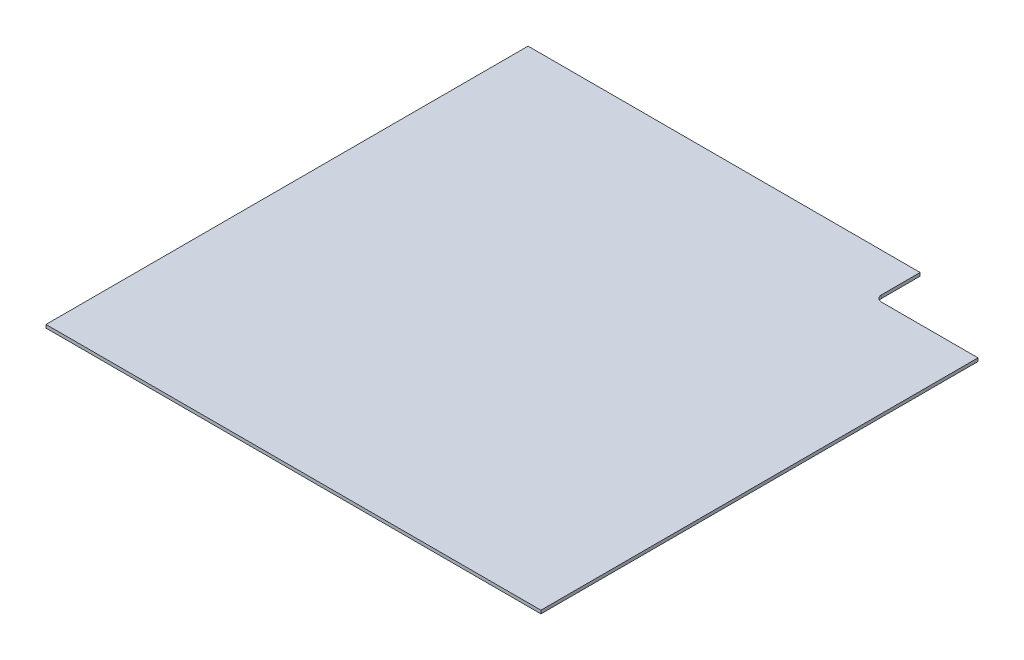
ISO-10303-21;
HEADER;
FILE_DESCRIPTION(('STEP AP214'),'2;1');
FILE_NAME('part.step','',(''),(''),'','','');
FILE_SCHEMA(('AUTOMOTIVE_DESIGN { 1 0 10303 214 1 1 1 1 }'));
ENDSEC;
DATA;
#1=APPLICATION_CONTEXT('core data for automotive mechanical design processes');
#2=APPLICATION_PROTOCOL_DEFINITION('international standard','automotive_design',2000,#1);
#3=PRODUCT_CONTEXT('',#1,'mechanical');
#4=PRODUCT('Part','Part','',(#3));
#5=PRODUCT_RELATED_PRODUCT_CATEGORY('part','',(#4));
#6=PRODUCT_DEFINITION_FORMATION('','',#4);
#7=PRODUCT_DEFINITION_CONTEXT('part definition',#1,'design');
#8=PRODUCT_DEFINITION('design','',#6,#7);
#9=PRODUCT_DEFINITION_SHAPE('','',#8);
#10=(LENGTH_UNIT() NAMED_UNIT(*) SI_UNIT(.MILLI.,.METRE.));
#11=(NAMED_UNIT(*) PLANE_ANGLE_UNIT() SI_UNIT($,.RADIAN.));
#12=(NAMED_UNIT(*) SI_UNIT($,.STERADIAN.) SOLID_ANGLE_UNIT());
#13=UNCERTAINTY_MEASURE_WITH_UNIT(LENGTH_MEASURE(1.E-05),#10,'distance_accuracy_value','');
#14=(GEOMETRIC_REPRESENTATION_CONTEXT(3) GLOBAL_UNCERTAINTY_ASSIGNED_CONTEXT((#13)) GLOBAL_UNIT_ASSIGNED_CONTEXT((#10,
#11,#12)) REPRESENTATION_CONTEXT('',''));
#15=CARTESIAN_POINT('',(0.,0.,0.));
#16=DIRECTION('',(0.,0.,1.));
#17=DIRECTION('',(1.,0.,0.));
#18=AXIS2_PLACEMENT_3D('',#15,#16,#17);
#19=CARTESIAN_POINT('',(5845.175,-3.175,238.125));
#20=DIRECTION('',(0.,-1.,0.));
#21=DIRECTION('',(0.,0.,-1.));
#22=AXIS2_PLACEMENT_3D('',#19,#20,#21);
#23=PLANE('',#22);
#24=DIRECTION('',(1.,0.,0.));
#25=VECTOR('',#24,1.);
#26=CARTESIAN_POINT('',(5845.175,-3.175,476.25));
#27=LINE('',#26,#25);
#28=CARTESIAN_POINT('',(5600.7,-3.175,476.25));
#29=VERTEX_POINT('',#28);
#30=CARTESIAN_POINT('',(6089.65,-3.175,476.25));
#31=VERTEX_POINT('',#30);
#32=EDGE_CURVE('E76',#29,#31,#27,.T.);
#33=ORIENTED_EDGE('',*,*,#32,.F.);
#34=DIRECTION('',(0.,0.,1.));
#35=VECTOR('',#34,1.);
#36=CARTESIAN_POINT('',(5600.7,-3.175,238.125));
#37=LINE('',#36,#35);
#38=CARTESIAN_POINT('',(5600.7,-3.175,0.));
#39=VERTEX_POINT('',#38);
#40=EDGE_CURVE('E96',#39,#29,#37,.T.);
#41=ORIENTED_EDGE('',*,*,#40,.F.);
#42=DIRECTION('',(1.,0.,0.));
#43=VECTOR('',#42,1.);
#44=CARTESIAN_POINT('',(5845.175,-3.175,0.));
#45=LINE('',#44,#43);
#46=CARTESIAN_POINT('',(5988.05,-3.175,0.));
#47=VERTEX_POINT('',#46);
#48=EDGE_CURVE('E112',#39,#47,#45,.T.);
#49=ORIENTED_EDGE('',*,*,#48,.T.);
#50=DIRECTION('',(0.,0.,-1.));
#51=VECTOR('',#50,1.);
#52=CARTESIAN_POINT('',(5988.05,-3.175,22.225));
#53=LINE('',#52,#51);
#54=CARTESIAN_POINT('',(5988.05,-3.175,38.1));
#55=VERTEX_POINT('',#54);
#56=EDGE_CURVE('E45',#55,#47,#53,.T.);
#57=ORIENTED_EDGE('',*,*,#56,.F.);
#58=CARTESIAN_POINT('',(5994.4,-3.175,38.1));
#59=DIRECTION('',(0.,1.,0.));
#60=DIRECTION('',(0.,0.,1.));
#61=AXIS2_PLACEMENT_3D('',#58,#59,#60);
#62=CIRCLE('',#61,6.35);
#63=CARTESIAN_POINT('',(5994.4,-3.175,44.45));
#64=VERTEX_POINT('',#63);
#65=EDGE_CURVE('E17',#55,#64,#62,.T.);
#66=ORIENTED_EDGE('',*,*,#65,.T.);
#67=DIRECTION('',(1.,0.,0.));
#68=VECTOR('',#67,1.);
#69=CARTESIAN_POINT('',(6044.96930074391,-3.175,44.45));
#70=LINE('',#69,#68);
#71=CARTESIAN_POINT('',(6089.65,-3.175,44.45));
#72=VERTEX_POINT('',#71);
#73=EDGE_CURVE('E87',#64,#72,#70,.T.);
#74=ORIENTED_EDGE('',*,*,#73,.T.);
#75=DIRECTION('',(0.,0.,1.));
#76=VECTOR('',#75,1.);
#77=CARTESIAN_POINT('',(6089.65,-3.175,238.125));
#78=LINE('',#77,#76);
#79=EDGE_CURVE('E84',#72,#31,#78,.T.);
#80=ORIENTED_EDGE('',*,*,#79,.T.);
#81=EDGE_LOOP('',(#33,#41,#49,#57,#66,#74,#80));
#82=FACE_BOUND('',#81,.T.);
#83=ADVANCED_FACE('F14',(#82),#23,.T.);
#84=CARTESIAN_POINT('',(6089.65,-3.175,238.125));
#85=DIRECTION('',(-1.,0.,0.));
#86=DIRECTION('',(0.,0.,1.));
#87=AXIS2_PLACEMENT_3D('',#84,#85,#86);
#88=PLANE('',#87);
#89=DIRECTION('',(0.,0.,-1.));
#90=VECTOR('',#89,1.);
#91=CARTESIAN_POINT('',(6089.65,0.,238.125));
#92=LINE('',#91,#90);
#93=CARTESIAN_POINT('',(6089.65,0.,44.45));
#94=VERTEX_POINT('',#93);
#95=CARTESIAN_POINT('',(6089.65,0.,476.25));
#96=VERTEX_POINT('',#95);
#97=EDGE_CURVE('E95',#94,#96,#92,.F.);
#98=ORIENTED_EDGE('',*,*,#97,.T.);
#99=DIRECTION('',(0.,1.,0.));
#100=VECTOR('',#99,1.);
#101=CARTESIAN_POINT('',(6089.65,-3.175,476.25));
#102=LINE('',#101,#100);
#103=EDGE_CURVE('E81',#31,#96,#102,.T.);
#104=ORIENTED_EDGE('',*,*,#103,.F.);
#105=ORIENTED_EDGE('',*,*,#79,.F.);
#106=DIRECTION('',(0.,1.,0.));
#107=VECTOR('',#106,1.);
#108=CARTESIAN_POINT('',(6089.65,0.00199999999999983,44.45));
#109=LINE('',#108,#107);
#110=EDGE_CURVE('E139',#72,#94,#109,.T.);
#111=ORIENTED_EDGE('',*,*,#110,.T.);
#112=EDGE_LOOP('',(#98,#104,#105,#111));
#113=FACE_BOUND('',#112,.T.);
#114=ADVANCED_FACE('F93',(#113),#88,.F.);
#115=CARTESIAN_POINT('',(5845.175,-3.175,476.25));
#116=DIRECTION('',(0.,0.,1.));
#117=DIRECTION('',(1.,0.,0.));
#118=AXIS2_PLACEMENT_3D('',#115,#116,#117);
#119=PLANE('',#118);
#120=ORIENTED_EDGE('',*,*,#32,.T.);
#121=ORIENTED_EDGE('',*,*,#103,.T.);
#122=DIRECTION('',(1.,0.,0.));
#123=VECTOR('',#122,1.);
#124=CARTESIAN_POINT('',(5845.175,0.,476.25));
#125=LINE('',#124,#123);
#126=CARTESIAN_POINT('',(5600.7,0.,476.25));
#127=VERTEX_POINT('',#126);
#128=EDGE_CURVE('E144',#96,#127,#125,.F.);
#129=ORIENTED_EDGE('',*,*,#128,.T.);
#130=DIRECTION('',(0.,1.,0.));
#131=VECTOR('',#130,1.);
#132=CARTESIAN_POINT('',(5600.7,-3.175,476.25));
#133=LINE('',#132,#131);
#134=EDGE_CURVE('E83',#29,#127,#133,.T.);
#135=ORIENTED_EDGE('',*,*,#134,.F.);
#136=EDGE_LOOP('',(#120,#121,#129,#135));
#137=FACE_BOUND('',#136,.T.);
#138=ADVANCED_FACE('F78',(#137),#119,.T.);
#139=CARTESIAN_POINT('',(5600.7,-3.175,238.125));
#140=DIRECTION('',(-1.,0.,0.));
#141=DIRECTION('',(0.,0.,1.));
#142=AXIS2_PLACEMENT_3D('',#139,#140,#141);
#143=PLANE('',#142);
#144=ORIENTED_EDGE('',*,*,#40,.T.);
#145=ORIENTED_EDGE('',*,*,#134,.T.);
#146=DIRECTION('',(0.,0.,-1.));
#147=VECTOR('',#146,1.);
#148=CARTESIAN_POINT('',(5600.7,0.,238.125));
#149=LINE('',#148,#147);
#150=CARTESIAN_POINT('',(5600.7,0.,0.));
#151=VERTEX_POINT('',#150);
#152=EDGE_CURVE('E131',#127,#151,#149,.T.);
#153=ORIENTED_EDGE('',*,*,#152,.T.);
#154=DIRECTION('',(0.,1.,0.));
#155=VECTOR('',#154,1.);
#156=CARTESIAN_POINT('',(5600.7,-3.175,0.));
#157=LINE('',#156,#155);
#158=EDGE_CURVE('E116',#151,#39,#157,.F.);
#159=ORIENTED_EDGE('',*,*,#158,.T.);
#160=EDGE_LOOP('',(#144,#145,#153,#159));
#161=FACE_BOUND('',#160,.T.);
#162=ADVANCED_FACE('F169',(#161),#143,.T.);
#163=CARTESIAN_POINT('',(5845.175,-3.175,0.));
#164=DIRECTION('',(0.,0.,1.));
#165=DIRECTION('',(1.,0.,0.));
#166=AXIS2_PLACEMENT_3D('',#163,#164,#165);
#167=PLANE('',#166);
#168=DIRECTION('',(0.,1.,0.));
#169=VECTOR('',#168,1.);
#170=CARTESIAN_POINT('',(5988.05,0.00199999999999983,0.));
#171=LINE('',#170,#169);
#172=CARTESIAN_POINT('',(5988.05,0.,0.));
#173=VERTEX_POINT('',#172);
#174=EDGE_CURVE('E111',#47,#173,#171,.T.);
#175=ORIENTED_EDGE('',*,*,#174,.F.);
#176=ORIENTED_EDGE('',*,*,#48,.F.);
#177=ORIENTED_EDGE('',*,*,#158,.F.);
#178=DIRECTION('',(1.,0.,0.));
#179=VECTOR('',#178,1.);
#180=CARTESIAN_POINT('',(5845.175,0.,0.));
#181=LINE('',#180,#179);
#182=EDGE_CURVE('E127',#151,#173,#181,.T.);
#183=ORIENTED_EDGE('',*,*,#182,.T.);
#184=EDGE_LOOP('',(#175,#176,#177,#183));
#185=FACE_BOUND('',#184,.T.);
#186=ADVANCED_FACE('F173',(#185),#167,.F.);
#187=CARTESIAN_POINT('',(5988.05,0.00199999999999983,22.225));
#188=DIRECTION('',(1.,0.,0.));
#189=DIRECTION('',(0.,0.,-1.));
#190=AXIS2_PLACEMENT_3D('',#187,#188,#189);
#191=PLANE('',#190);
#192=ORIENTED_EDGE('',*,*,#56,.T.);
#193=ORIENTED_EDGE('',*,*,#174,.T.);
#194=DIRECTION('',(0.,0.,-1.));
#195=VECTOR('',#194,1.);
#196=CARTESIAN_POINT('',(5988.05,0.,238.125));
#197=LINE('',#196,#195);
#198=CARTESIAN_POINT('',(5988.05,0.,38.1));
#199=VERTEX_POINT('',#198);
#200=EDGE_CURVE('E123',#173,#199,#197,.F.);
#201=ORIENTED_EDGE('',*,*,#200,.T.);
#202=DIRECTION('',(0.,1.,0.));
#203=VECTOR('',#202,1.);
#204=CARTESIAN_POINT('',(5988.05,0.00199999999999983,38.1));
#205=LINE('',#204,#203);
#206=EDGE_CURVE('E147',#199,#55,#205,.F.);
#207=ORIENTED_EDGE('',*,*,#206,.T.);
#208=EDGE_LOOP('',(#192,#193,#201,#207));
#209=FACE_BOUND('',#208,.T.);
#210=ADVANCED_FACE('F174',(#209),#191,.T.);
#211=CARTESIAN_POINT('',(5994.4,0.00199999999999983,38.1));
#212=DIRECTION('',(0.,1.,0.));
#213=DIRECTION('',(0.,0.,1.));
#214=AXIS2_PLACEMENT_3D('',#211,#212,#213);
#215=CYLINDRICAL_SURFACE('',#214,6.35);
#216=DIRECTION('',(0.,1.,0.));
#217=VECTOR('',#216,1.);
#218=CARTESIAN_POINT('',(5994.4,0.00199999999999983,44.45));
#219=LINE('',#218,#217);
#220=CARTESIAN_POINT('',(5994.4,0.,44.45));
#221=VERTEX_POINT('',#220);
#222=EDGE_CURVE('E31',#221,#64,#219,.F.);
#223=ORIENTED_EDGE('',*,*,#222,.T.);
#224=ORIENTED_EDGE('',*,*,#65,.F.);
#225=ORIENTED_EDGE('',*,*,#206,.F.);
#226=CARTESIAN_POINT('',(5994.4,0.,38.1));
#227=DIRECTION('',(0.,1.,0.));
#228=DIRECTION('',(0.,0.,1.));
#229=AXIS2_PLACEMENT_3D('',#226,#227,#228);
#230=CIRCLE('',#229,6.35);
#231=EDGE_CURVE('E23',#199,#221,#230,.T.);
#232=ORIENTED_EDGE('',*,*,#231,.T.);
#233=EDGE_LOOP('',(#223,#224,#225,#232));
#234=FACE_BOUND('',#233,.T.);
#235=ADVANCED_FACE('F176',(#234),#215,.F.);
#236=CARTESIAN_POINT('',(6044.96930074391,0.00199999999999983,44.45));
#237=DIRECTION('',(0.,0.,1.));
#238=DIRECTION('',(1.,0.,0.));
#239=AXIS2_PLACEMENT_3D('',#236,#237,#238);
#240=PLANE('',#239);
#241=ORIENTED_EDGE('',*,*,#222,.F.);
#242=DIRECTION('',(1.,0.,0.));
#243=VECTOR('',#242,1.);
#244=CARTESIAN_POINT('',(5845.175,0.,44.45));
#245=LINE('',#244,#243);
#246=EDGE_CURVE('E9',#221,#94,#245,.T.);
#247=ORIENTED_EDGE('',*,*,#246,.T.);
#248=ORIENTED_EDGE('',*,*,#110,.F.);
#249=ORIENTED_EDGE('',*,*,#73,.F.);
#250=EDGE_LOOP('',(#241,#247,#248,#249));
#251=FACE_BOUND('',#250,.T.);
#252=ADVANCED_FACE('F175',(#251),#240,.F.);
#253=CARTESIAN_POINT('',(5845.175,0.,238.125));
#254=DIRECTION('',(0.,-1.,0.));
#255=DIRECTION('',(0.,0.,-1.));
#256=AXIS2_PLACEMENT_3D('',#253,#254,#255);
#257=PLANE('',#256);
#258=ORIENTED_EDGE('',*,*,#231,.F.);
#259=ORIENTED_EDGE('',*,*,#200,.F.);
#260=ORIENTED_EDGE('',*,*,#182,.F.);
#261=ORIENTED_EDGE('',*,*,#152,.F.);
#262=ORIENTED_EDGE('',*,*,#128,.F.);
#263=ORIENTED_EDGE('',*,*,#97,.F.);
#264=ORIENTED_EDGE('',*,*,#246,.F.);
#265=EDGE_LOOP('',(#258,#259,#260,#261,#262,#263,#264));
#266=FACE_BOUND('',#265,.T.);
#267=ADVANCED_FACE('F166',(#266),#257,.F.);
#268=CLOSED_SHELL('',(#83,#114,#138,#162,#186,#210,#235,#252,#267));
#269=MANIFOLD_SOLID_BREP('B1',#268);
#270=ADVANCED_BREP_SHAPE_REPRESENTATION('',(#18,#269),#14);
#271=SHAPE_DEFINITION_REPRESENTATION(#9,#270);
ENDSEC;
END-ISO-10303-21;
